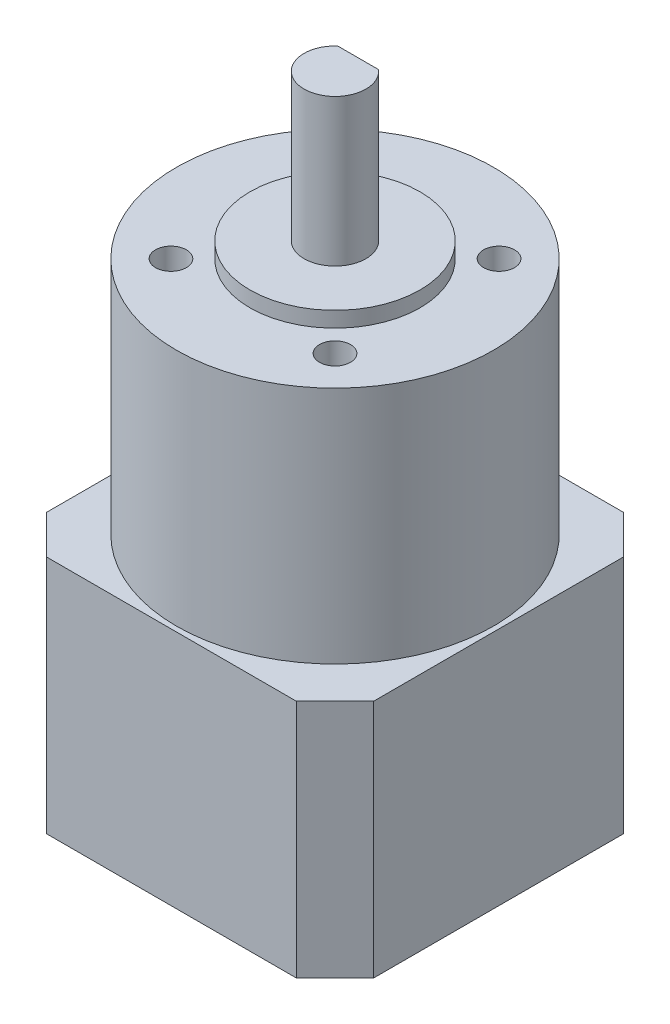
ISO-10303-21;
HEADER;
FILE_DESCRIPTION(('STEP AP214'),'2;1');
FILE_NAME('part.step','',(''),(''),'','','');
FILE_SCHEMA(('AUTOMOTIVE_DESIGN { 1 0 10303 214 1 1 1 1 }'));
ENDSEC;
DATA;
#1=APPLICATION_CONTEXT('core data for automotive mechanical design processes');
#2=APPLICATION_PROTOCOL_DEFINITION('international standard','automotive_design',2000,#1);
#3=PRODUCT_CONTEXT('',#1,'mechanical');
#4=PRODUCT('Part','Part','',(#3));
#5=PRODUCT_RELATED_PRODUCT_CATEGORY('part','',(#4));
#6=PRODUCT_DEFINITION_FORMATION('','',#4);
#7=PRODUCT_DEFINITION_CONTEXT('part definition',#1,'design');
#8=PRODUCT_DEFINITION('design','',#6,#7);
#9=PRODUCT_DEFINITION_SHAPE('','',#8);
#10=(LENGTH_UNIT() NAMED_UNIT(*) SI_UNIT(.MILLI.,.METRE.));
#11=(NAMED_UNIT(*) PLANE_ANGLE_UNIT() SI_UNIT($,.RADIAN.));
#12=(NAMED_UNIT(*) SI_UNIT($,.STERADIAN.) SOLID_ANGLE_UNIT());
#13=UNCERTAINTY_MEASURE_WITH_UNIT(LENGTH_MEASURE(1.E-05),#10,'distance_accuracy_value','');
#14=(GEOMETRIC_REPRESENTATION_CONTEXT(3) GLOBAL_UNCERTAINTY_ASSIGNED_CONTEXT((#13)) GLOBAL_UNIT_ASSIGNED_CONTEXT((#10,
#11,#12)) REPRESENTATION_CONTEXT('',''));
#15=CARTESIAN_POINT('',(0.,0.,0.));
#16=DIRECTION('',(0.,0.,1.));
#17=DIRECTION('',(1.,0.,0.));
#18=AXIS2_PLACEMENT_3D('',#15,#16,#17);
#19=CARTESIAN_POINT('',(0.,21.,0.));
#20=DIRECTION('',(0.,1.,0.));
#21=DIRECTION('',(0.,0.,1.));
#22=AXIS2_PLACEMENT_3D('',#19,#20,#21);
#23=PLANE('',#22);
#24=DIRECTION('',(1.,0.,0.));
#25=VECTOR('',#24,1.);
#26=CARTESIAN_POINT('',(-2.64575131106459,21.,-3.));
#27=LINE('',#26,#25);
#28=CARTESIAN_POINT('',(2.64575131106459,21.,-3.));
#29=VERTEX_POINT('',#28);
#30=CARTESIAN_POINT('',(-2.64575131106459,21.,-3.));
#31=VERTEX_POINT('',#30);
#32=EDGE_CURVE('E105',#29,#31,#27,.F.);
#33=ORIENTED_EDGE('',*,*,#32,.T.);
#34=CARTESIAN_POINT('',(0.,21.,0.));
#35=DIRECTION('',(0.,-1.,0.));
#36=DIRECTION('',(0.,0.,-1.));
#37=AXIS2_PLACEMENT_3D('',#34,#35,#36);
#38=CIRCLE('',#37,4.);
#39=EDGE_CURVE('E20',#29,#31,#38,.T.);
#40=ORIENTED_EDGE('',*,*,#39,.F.);
#41=EDGE_LOOP('',(#33,#40));
#42=FACE_BOUND('',#41,.T.);
#43=ADVANCED_FACE('F17',(#42),#23,.T.);
#44=CARTESIAN_POINT('',(0.,8.,0.));
#45=DIRECTION('',(0.,-1.,0.));
#46=DIRECTION('',(0.,0.,-1.));
#47=AXIS2_PLACEMENT_3D('',#44,#45,#46);
#48=PLANE('',#47);
#49=CARTESIAN_POINT('',(0.,8.,0.));
#50=DIRECTION('',(0.,-1.,0.));
#51=DIRECTION('',(0.,0.,-1.));
#52=AXIS2_PLACEMENT_3D('',#49,#50,#51);
#53=CIRCLE('',#52,4.);
#54=CARTESIAN_POINT('',(-2.64575131106459,8.,-3.));
#55=VERTEX_POINT('',#54);
#56=CARTESIAN_POINT('',(2.64575131106459,8.,-3.));
#57=VERTEX_POINT('',#56);
#58=EDGE_CURVE('E91',#55,#57,#53,.T.);
#59=ORIENTED_EDGE('',*,*,#58,.F.);
#60=DIRECTION('',(1.,0.,0.));
#61=VECTOR('',#60,1.);
#62=CARTESIAN_POINT('',(-2.64575131106459,8.,-3.));
#63=LINE('',#62,#61);
#64=EDGE_CURVE('E107',#55,#57,#63,.T.);
#65=ORIENTED_EDGE('',*,*,#64,.T.);
#66=EDGE_LOOP('',(#59,#65));
#67=FACE_BOUND('',#66,.T.);
#68=ADVANCED_FACE('F154',(#67),#48,.F.);
#69=CARTESIAN_POINT('',(-2.64575131106459,8.,-3.));
#70=DIRECTION('',(0.,0.,1.));
#71=DIRECTION('',(1.,0.,0.));
#72=AXIS2_PLACEMENT_3D('',#69,#70,#71);
#73=PLANE('',#72);
#74=DIRECTION('',(0.,-1.,0.));
#75=VECTOR('',#74,1.);
#76=CARTESIAN_POINT('',(2.64575131106459,21.,-3.));
#77=LINE('',#76,#75);
#78=EDGE_CURVE('E102',#57,#29,#77,.F.);
#79=ORIENTED_EDGE('',*,*,#78,.F.);
#80=ORIENTED_EDGE('',*,*,#64,.F.);
#81=DIRECTION('',(0.,-1.,0.));
#82=VECTOR('',#81,1.);
#83=CARTESIAN_POINT('',(-2.64575131106459,21.,-3.));
#84=LINE('',#83,#82);
#85=EDGE_CURVE('E100',#31,#55,#84,.T.);
#86=ORIENTED_EDGE('',*,*,#85,.F.);
#87=ORIENTED_EDGE('',*,*,#32,.F.);
#88=EDGE_LOOP('',(#79,#80,#86,#87));
#89=FACE_BOUND('',#88,.T.);
#90=ADVANCED_FACE('F109',(#89),#73,.F.);
#91=CARTESIAN_POINT('',(0.,21.,0.));
#92=DIRECTION('',(0.,-1.,0.));
#93=DIRECTION('',(0.,0.,-1.));
#94=AXIS2_PLACEMENT_3D('',#91,#92,#93);
#95=CYLINDRICAL_SURFACE('',#94,4.);
#96=CARTESIAN_POINT('',(0.,2.,0.));
#97=DIRECTION('',(0.,-1.,0.));
#98=DIRECTION('',(0.,0.,-1.));
#99=AXIS2_PLACEMENT_3D('',#96,#97,#98);
#100=CIRCLE('',#99,4.);
#101=CARTESIAN_POINT('',(0.,2.,-4.));
#102=VERTEX_POINT('',#101);
#103=EDGE_CURVE('E148',#102,#102,#100,.T.);
#104=ORIENTED_EDGE('',*,*,#103,.F.);
#105=EDGE_LOOP('',(#104));
#106=FACE_BOUND('',#105,.T.);
#107=ORIENTED_EDGE('',*,*,#58,.T.);
#108=ORIENTED_EDGE('',*,*,#78,.T.);
#109=ORIENTED_EDGE('',*,*,#39,.T.);
#110=ORIENTED_EDGE('',*,*,#85,.T.);
#111=EDGE_LOOP('',(#107,#108,#109,#110));
#112=FACE_BOUND('',#111,.T.);
#113=ADVANCED_FACE('F98',(#106,#112),#95,.T.);
#114=CARTESIAN_POINT('',(-16.15,-61.9,-16.15));
#115=DIRECTION('',(0.,-1.,0.));
#116=DIRECTION('',(0.,0.,-1.));
#117=AXIS2_PLACEMENT_3D('',#114,#115,#116);
#118=PLANE('',#117);
#119=DIRECTION('',(0.,0.,1.));
#120=VECTOR('',#119,1.);
#121=CARTESIAN_POINT('',(21.15,-61.9,16.15));
#122=LINE('',#121,#120);
#123=CARTESIAN_POINT('',(21.15,-61.9,-16.15));
#124=VERTEX_POINT('',#123);
#125=CARTESIAN_POINT('',(21.15,-61.9,16.1500000000001));
#126=VERTEX_POINT('',#125);
#127=EDGE_CURVE('E419',#124,#126,#122,.T.);
#128=ORIENTED_EDGE('',*,*,#127,.T.);
#129=DIRECTION('',(0.707106781186552,0.,-0.707106781186543));
#130=VECTOR('',#129,1.);
#131=CARTESIAN_POINT('',(21.1499999999999,-61.9,16.1500000000001));
#132=LINE('',#131,#130);
#133=CARTESIAN_POINT('',(16.1499999999999,-61.9,21.15));
#134=VERTEX_POINT('',#133);
#135=EDGE_CURVE('E422',#134,#126,#132,.T.);
#136=ORIENTED_EDGE('',*,*,#135,.F.);
#137=DIRECTION('',(-1.,0.,0.));
#138=VECTOR('',#137,1.);
#139=CARTESIAN_POINT('',(-16.15,-61.9,21.15));
#140=LINE('',#139,#138);
#141=CARTESIAN_POINT('',(-16.1500000000001,-61.9,21.15));
#142=VERTEX_POINT('',#141);
#143=EDGE_CURVE('E439',#134,#142,#140,.T.);
#144=ORIENTED_EDGE('',*,*,#143,.T.);
#145=DIRECTION('',(0.70710678118654,0.,0.707106781186555));
#146=VECTOR('',#145,1.);
#147=CARTESIAN_POINT('',(-16.1500000000002,-61.9,21.1499999999998));
#148=LINE('',#147,#146);
#149=CARTESIAN_POINT('',(-21.15,-61.9,16.1499999999999));
#150=VERTEX_POINT('',#149);
#151=EDGE_CURVE('E147',#150,#142,#148,.T.);
#152=ORIENTED_EDGE('',*,*,#151,.F.);
#153=DIRECTION('',(0.,0.,-1.));
#154=VECTOR('',#153,1.);
#155=CARTESIAN_POINT('',(-21.15,-61.9,16.15));
#156=LINE('',#155,#154);
#157=CARTESIAN_POINT('',(-21.15,-61.9,-16.1499999999999));
#158=VERTEX_POINT('',#157);
#159=EDGE_CURVE('E150',#150,#158,#156,.T.);
#160=ORIENTED_EDGE('',*,*,#159,.T.);
#161=DIRECTION('',(-0.707106781186548,0.,0.707106781186548));
#162=VECTOR('',#161,1.);
#163=CARTESIAN_POINT('',(-21.15,-61.9,-16.15));
#164=LINE('',#163,#162);
#165=CARTESIAN_POINT('',(-16.15,-61.9,-21.15));
#166=VERTEX_POINT('',#165);
#167=EDGE_CURVE('E453',#166,#158,#164,.T.);
#168=ORIENTED_EDGE('',*,*,#167,.F.);
#169=DIRECTION('',(1.,0.,0.));
#170=VECTOR('',#169,1.);
#171=CARTESIAN_POINT('',(-16.15,-61.9,-21.15));
#172=LINE('',#171,#170);
#173=CARTESIAN_POINT('',(16.15,-61.9,-21.15));
#174=VERTEX_POINT('',#173);
#175=EDGE_CURVE('E448',#166,#174,#172,.T.);
#176=ORIENTED_EDGE('',*,*,#175,.T.);
#177=DIRECTION('',(-0.707106781186545,0.,-0.70710678118655));
#178=VECTOR('',#177,1.);
#179=CARTESIAN_POINT('',(16.1500000000001,-61.9,-21.1499999999999));
#180=LINE('',#179,#178);
#181=EDGE_CURVE('E425',#124,#174,#180,.T.);
#182=ORIENTED_EDGE('',*,*,#181,.F.);
#183=EDGE_LOOP('',(#128,#136,#144,#152,#160,#168,#176,#182));
#184=FACE_BOUND('',#183,.T.);
#185=ADVANCED_FACE('F248',(#184),#118,.T.);
#186=CARTESIAN_POINT('',(-10.6066017177976,-5.,10.6066017177982));
#187=DIRECTION('',(0.,1.,0.));
#188=DIRECTION('',(0.,0.,1.));
#189=AXIS2_PLACEMENT_3D('',#186,#187,#188);
#190=PLANE('',#189);
#191=CARTESIAN_POINT('',(-10.6066017177976,-5.,10.6066017177982));
#192=DIRECTION('',(0.,1.,0.));
#193=DIRECTION('',(0.,0.,1.));
#194=AXIS2_PLACEMENT_3D('',#191,#192,#193);
#195=CIRCLE('',#194,2.);
#196=CARTESIAN_POINT('',(-10.6066017177976,-5.,12.6066017177982));
#197=VERTEX_POINT('',#196);
#198=EDGE_CURVE('E144',#197,#197,#195,.T.);
#199=ORIENTED_EDGE('',*,*,#198,.T.);
#200=EDGE_LOOP('',(#199));
#201=FACE_BOUND('',#200,.T.);
#202=ADVANCED_FACE('F244',(#201),#190,.T.);
#203=CARTESIAN_POINT('',(10.6066017177988,-5.,10.6066017177976));
#204=DIRECTION('',(0.,1.,0.));
#205=DIRECTION('',(0.,0.,1.));
#206=AXIS2_PLACEMENT_3D('',#203,#204,#205);
#207=PLANE('',#206);
#208=CARTESIAN_POINT('',(10.6066017177988,-5.,10.6066017177976));
#209=DIRECTION('',(0.,1.,0.));
#210=DIRECTION('',(0.,0.,1.));
#211=AXIS2_PLACEMENT_3D('',#208,#209,#210);
#212=CIRCLE('',#211,2.);
#213=CARTESIAN_POINT('',(10.6066017177988,-5.,12.6066017177976));
#214=VERTEX_POINT('',#213);
#215=EDGE_CURVE('E141',#214,#214,#212,.T.);
#216=ORIENTED_EDGE('',*,*,#215,.T.);
#217=EDGE_LOOP('',(#216));
#218=FACE_BOUND('',#217,.T.);
#219=ADVANCED_FACE('F240',(#218),#207,.T.);
#220=CARTESIAN_POINT('',(10.6066017177982,-5.,-10.6066017177988));
#221=DIRECTION('',(0.,1.,0.));
#222=DIRECTION('',(0.,0.,1.));
#223=AXIS2_PLACEMENT_3D('',#220,#221,#222);
#224=PLANE('',#223);
#225=CARTESIAN_POINT('',(10.6066017177982,-5.,-10.6066017177988));
#226=DIRECTION('',(0.,1.,0.));
#227=DIRECTION('',(0.,0.,1.));
#228=AXIS2_PLACEMENT_3D('',#225,#226,#227);
#229=CIRCLE('',#228,2.);
#230=CARTESIAN_POINT('',(10.6066017177982,-5.,-8.60660171779881));
#231=VERTEX_POINT('',#230);
#232=EDGE_CURVE('E138',#231,#231,#229,.T.);
#233=ORIENTED_EDGE('',*,*,#232,.T.);
#234=EDGE_LOOP('',(#233));
#235=FACE_BOUND('',#234,.T.);
#236=ADVANCED_FACE('F236',(#235),#224,.T.);
#237=CARTESIAN_POINT('',(-10.6066017177982,-5.,-10.6066017177982));
#238=DIRECTION('',(0.,1.,0.));
#239=DIRECTION('',(0.,0.,1.));
#240=AXIS2_PLACEMENT_3D('',#237,#238,#239);
#241=PLANE('',#240);
#242=CARTESIAN_POINT('',(-10.6066017177982,-5.,-10.6066017177982));
#243=DIRECTION('',(0.,1.,0.));
#244=DIRECTION('',(0.,0.,1.));
#245=AXIS2_PLACEMENT_3D('',#242,#243,#244);
#246=CIRCLE('',#245,2.);
#247=CARTESIAN_POINT('',(-10.6066017177982,-5.,-8.60660171779821));
#248=VERTEX_POINT('',#247);
#249=EDGE_CURVE('E135',#248,#248,#246,.T.);
#250=ORIENTED_EDGE('',*,*,#249,.T.);
#251=EDGE_LOOP('',(#250));
#252=FACE_BOUND('',#251,.T.);
#253=ADVANCED_FACE('F232',(#252),#241,.T.);
#254=CARTESIAN_POINT('',(0.,2.,0.));
#255=DIRECTION('',(0.,1.,0.));
#256=DIRECTION('',(0.,0.,1.));
#257=AXIS2_PLACEMENT_3D('',#254,#255,#256);
#258=PLANE('',#257);
#259=ORIENTED_EDGE('',*,*,#103,.T.);
#260=EDGE_LOOP('',(#259));
#261=FACE_BOUND('',#260,.T.);
#262=CARTESIAN_POINT('',(0.,2.,0.));
#263=DIRECTION('',(0.,-1.,0.));
#264=DIRECTION('',(0.,0.,-1.));
#265=AXIS2_PLACEMENT_3D('',#262,#263,#264);
#266=CIRCLE('',#265,11.);
#267=CARTESIAN_POINT('',(0.,2.,-11.));
#268=VERTEX_POINT('',#267);
#269=EDGE_CURVE('E131',#268,#268,#266,.T.);
#270=ORIENTED_EDGE('',*,*,#269,.F.);
#271=EDGE_LOOP('',(#270));
#272=FACE_BOUND('',#271,.T.);
#273=ADVANCED_FACE('F228',(#261,#272),#258,.T.);
#274=CARTESIAN_POINT('',(-21.15,-61.9,16.15));
#275=DIRECTION('',(1.,0.,0.));
#276=DIRECTION('',(0.,0.,-1.));
#277=AXIS2_PLACEMENT_3D('',#274,#275,#276);
#278=PLANE('',#277);
#279=DIRECTION('',(0.,1.,0.));
#280=VECTOR('',#279,1.);
#281=CARTESIAN_POINT('',(-21.15,-30.9,-16.15));
#282=LINE('',#281,#280);
#283=CARTESIAN_POINT('',(-21.15,-30.9,-16.15));
#284=VERTEX_POINT('',#283);
#285=EDGE_CURVE('E455',#158,#284,#282,.T.);
#286=ORIENTED_EDGE('',*,*,#285,.F.);
#287=ORIENTED_EDGE('',*,*,#159,.F.);
#288=DIRECTION('',(0.,1.,0.));
#289=VECTOR('',#288,1.);
#290=CARTESIAN_POINT('',(-21.15,-30.9,16.15));
#291=LINE('',#290,#289);
#292=CARTESIAN_POINT('',(-21.15,-30.9,16.15));
#293=VERTEX_POINT('',#292);
#294=EDGE_CURVE('E482',#293,#150,#291,.F.);
#295=ORIENTED_EDGE('',*,*,#294,.F.);
#296=DIRECTION('',(0.,0.,-1.));
#297=VECTOR('',#296,1.);
#298=CARTESIAN_POINT('',(-21.15,-30.9,-16.15));
#299=LINE('',#298,#297);
#300=EDGE_CURVE('E134',#293,#284,#299,.T.);
#301=ORIENTED_EDGE('',*,*,#300,.T.);
#302=EDGE_LOOP('',(#286,#287,#295,#301));
#303=FACE_BOUND('',#302,.T.);
#304=ADVANCED_FACE('F224',(#303),#278,.F.);
#305=CARTESIAN_POINT('',(-21.15,-30.9,-16.15));
#306=DIRECTION('',(-0.707106781186548,0.,-0.707106781186548));
#307=DIRECTION('',(-0.707106781186548,0.,0.707106781186548));
#308=AXIS2_PLACEMENT_3D('',#305,#306,#307);
#309=PLANE('',#308);
#310=DIRECTION('',(0.,1.,0.));
#311=VECTOR('',#310,1.);
#312=CARTESIAN_POINT('',(-16.15,-61.9,-21.15));
#313=LINE('',#312,#311);
#314=CARTESIAN_POINT('',(-16.15,-30.9,-21.15));
#315=VERTEX_POINT('',#314);
#316=EDGE_CURVE('E450',#315,#166,#313,.F.);
#317=ORIENTED_EDGE('',*,*,#316,.T.);
#318=ORIENTED_EDGE('',*,*,#167,.T.);
#319=ORIENTED_EDGE('',*,*,#285,.T.);
#320=DIRECTION('',(0.707106781186547,0.,-0.707106781186547));
#321=VECTOR('',#320,1.);
#322=CARTESIAN_POINT('',(-21.15,-30.9,-16.15));
#323=LINE('',#322,#321);
#324=EDGE_CURVE('E465',#284,#315,#323,.T.);
#325=ORIENTED_EDGE('',*,*,#324,.T.);
#326=EDGE_LOOP('',(#317,#318,#319,#325));
#327=FACE_BOUND('',#326,.T.);
#328=ADVANCED_FACE('F220',(#327),#309,.T.);
#329=CARTESIAN_POINT('',(-16.15,-61.9,-21.15));
#330=DIRECTION('',(0.,0.,1.));
#331=DIRECTION('',(1.,0.,0.));
#332=AXIS2_PLACEMENT_3D('',#329,#330,#331);
#333=PLANE('',#332);
#334=DIRECTION('',(0.,1.,0.));
#335=VECTOR('',#334,1.);
#336=CARTESIAN_POINT('',(16.1500000000001,-30.9,-21.1499999999999));
#337=LINE('',#336,#335);
#338=CARTESIAN_POINT('',(16.15,-30.9,-21.15));
#339=VERTEX_POINT('',#338);
#340=EDGE_CURVE('E445',#174,#339,#337,.T.);
#341=ORIENTED_EDGE('',*,*,#340,.F.);
#342=ORIENTED_EDGE('',*,*,#175,.F.);
#343=ORIENTED_EDGE('',*,*,#316,.F.);
#344=DIRECTION('',(1.,0.,0.));
#345=VECTOR('',#344,1.);
#346=CARTESIAN_POINT('',(-16.15,-30.9,-21.15));
#347=LINE('',#346,#345);
#348=EDGE_CURVE('E468',#315,#339,#347,.T.);
#349=ORIENTED_EDGE('',*,*,#348,.T.);
#350=EDGE_LOOP('',(#341,#342,#343,#349));
#351=FACE_BOUND('',#350,.T.);
#352=ADVANCED_FACE('F216',(#351),#333,.F.);
#353=CARTESIAN_POINT('',(16.1500000000001,-30.9,-21.1499999999999));
#354=DIRECTION('',(0.70710678118655,0.,-0.707106781186545));
#355=DIRECTION('',(-0.707106781186545,0.,-0.70710678118655));
#356=AXIS2_PLACEMENT_3D('',#353,#354,#355);
#357=PLANE('',#356);
#358=DIRECTION('',(0.,1.,0.));
#359=VECTOR('',#358,1.);
#360=CARTESIAN_POINT('',(21.15,-61.9,-16.15));
#361=LINE('',#360,#359);
#362=CARTESIAN_POINT('',(21.15,-30.9,-16.15));
#363=VERTEX_POINT('',#362);
#364=EDGE_CURVE('E429',#363,#124,#361,.F.);
#365=ORIENTED_EDGE('',*,*,#364,.T.);
#366=ORIENTED_EDGE('',*,*,#181,.T.);
#367=ORIENTED_EDGE('',*,*,#340,.T.);
#368=DIRECTION('',(0.707106781186548,0.,0.707106781186547));
#369=VECTOR('',#368,1.);
#370=CARTESIAN_POINT('',(16.1500000000001,-30.9,-21.1499999999999));
#371=LINE('',#370,#369);
#372=EDGE_CURVE('E470',#339,#363,#371,.T.);
#373=ORIENTED_EDGE('',*,*,#372,.T.);
#374=EDGE_LOOP('',(#365,#366,#367,#373));
#375=FACE_BOUND('',#374,.T.);
#376=ADVANCED_FACE('F212',(#375),#357,.T.);
#377=CARTESIAN_POINT('',(21.15,-61.9,16.15));
#378=DIRECTION('',(-1.,0.,0.));
#379=DIRECTION('',(0.,0.,1.));
#380=AXIS2_PLACEMENT_3D('',#377,#378,#379);
#381=PLANE('',#380);
#382=DIRECTION('',(0.,1.,0.));
#383=VECTOR('',#382,1.);
#384=CARTESIAN_POINT('',(21.1499999999999,-30.9,16.1500000000001));
#385=LINE('',#384,#383);
#386=CARTESIAN_POINT('',(21.15,-30.9,16.1500000000001));
#387=VERTEX_POINT('',#386);
#388=EDGE_CURVE('E428',#126,#387,#385,.T.);
#389=ORIENTED_EDGE('',*,*,#388,.F.);
#390=ORIENTED_EDGE('',*,*,#127,.F.);
#391=ORIENTED_EDGE('',*,*,#364,.F.);
#392=DIRECTION('',(0.,0.,-1.));
#393=VECTOR('',#392,1.);
#394=CARTESIAN_POINT('',(21.15,-30.9,-16.15));
#395=LINE('',#394,#393);
#396=EDGE_CURVE('E433',#363,#387,#395,.F.);
#397=ORIENTED_EDGE('',*,*,#396,.T.);
#398=EDGE_LOOP('',(#389,#390,#391,#397));
#399=FACE_BOUND('',#398,.T.);
#400=ADVANCED_FACE('F208',(#399),#381,.F.);
#401=CARTESIAN_POINT('',(21.1499999999999,-30.9,16.1500000000001));
#402=DIRECTION('',(0.707106781186543,0.,0.707106781186552));
#403=DIRECTION('',(0.707106781186552,0.,-0.707106781186543));
#404=AXIS2_PLACEMENT_3D('',#401,#402,#403);
#405=PLANE('',#404);
#406=DIRECTION('',(0.,1.,0.));
#407=VECTOR('',#406,1.);
#408=CARTESIAN_POINT('',(16.15,-61.9,21.15));
#409=LINE('',#408,#407);
#410=CARTESIAN_POINT('',(16.15,-30.9,21.15));
#411=VERTEX_POINT('',#410);
#412=EDGE_CURVE('E436',#411,#134,#409,.F.);
#413=ORIENTED_EDGE('',*,*,#412,.T.);
#414=ORIENTED_EDGE('',*,*,#135,.T.);
#415=ORIENTED_EDGE('',*,*,#388,.T.);
#416=DIRECTION('',(-0.707106781186548,0.,0.707106781186546));
#417=VECTOR('',#416,1.);
#418=CARTESIAN_POINT('',(21.1499999999999,-30.9,16.1500000000001));
#419=LINE('',#418,#417);
#420=EDGE_CURVE('E472',#387,#411,#419,.T.);
#421=ORIENTED_EDGE('',*,*,#420,.T.);
#422=EDGE_LOOP('',(#413,#414,#415,#421));
#423=FACE_BOUND('',#422,.T.);
#424=ADVANCED_FACE('F205',(#423),#405,.T.);
#425=CARTESIAN_POINT('',(-16.15,-61.9,21.15));
#426=DIRECTION('',(0.,0.,-1.));
#427=DIRECTION('',(-1.,0.,0.));
#428=AXIS2_PLACEMENT_3D('',#425,#426,#427);
#429=PLANE('',#428);
#430=DIRECTION('',(0.,1.,0.));
#431=VECTOR('',#430,1.);
#432=CARTESIAN_POINT('',(-16.1500000000002,-30.9,21.1499999999998));
#433=LINE('',#432,#431);
#434=CARTESIAN_POINT('',(-16.1500000000002,-30.9,21.15));
#435=VERTEX_POINT('',#434);
#436=EDGE_CURVE('E484',#142,#435,#433,.T.);
#437=ORIENTED_EDGE('',*,*,#436,.F.);
#438=ORIENTED_EDGE('',*,*,#143,.F.);
#439=ORIENTED_EDGE('',*,*,#412,.F.);
#440=DIRECTION('',(1.,0.,0.));
#441=VECTOR('',#440,1.);
#442=CARTESIAN_POINT('',(-16.15,-30.9,21.15));
#443=LINE('',#442,#441);
#444=EDGE_CURVE('E35',#411,#435,#443,.F.);
#445=ORIENTED_EDGE('',*,*,#444,.T.);
#446=EDGE_LOOP('',(#437,#438,#439,#445));
#447=FACE_BOUND('',#446,.T.);
#448=ADVANCED_FACE('F201',(#447),#429,.F.);
#449=CARTESIAN_POINT('',(-16.1500000000002,-30.9,21.1499999999998));
#450=DIRECTION('',(-0.707106781186555,0.,0.70710678118654));
#451=DIRECTION('',(0.70710678118654,0.,0.707106781186555));
#452=AXIS2_PLACEMENT_3D('',#449,#450,#451);
#453=PLANE('',#452);
#454=ORIENTED_EDGE('',*,*,#294,.T.);
#455=ORIENTED_EDGE('',*,*,#151,.T.);
#456=ORIENTED_EDGE('',*,*,#436,.T.);
#457=DIRECTION('',(-0.707106781186545,0.,-0.707106781186549));
#458=VECTOR('',#457,1.);
#459=CARTESIAN_POINT('',(-16.1500000000002,-30.9,21.1499999999998));
#460=LINE('',#459,#458);
#461=EDGE_CURVE('E130',#435,#293,#460,.T.);
#462=ORIENTED_EDGE('',*,*,#461,.T.);
#463=EDGE_LOOP('',(#454,#455,#456,#462));
#464=FACE_BOUND('',#463,.T.);
#465=ADVANCED_FACE('F197',(#464),#453,.T.);
#466=CARTESIAN_POINT('',(-10.6066017177976,-5.,10.6066017177982));
#467=DIRECTION('',(0.,1.,0.));
#468=DIRECTION('',(0.,0.,1.));
#469=AXIS2_PLACEMENT_3D('',#466,#467,#468);
#470=CYLINDRICAL_SURFACE('',#469,2.);
#471=ORIENTED_EDGE('',*,*,#198,.F.);
#472=EDGE_LOOP('',(#471));
#473=FACE_BOUND('',#472,.T.);
#474=CARTESIAN_POINT('',(-10.6066017177976,0.,10.6066017177982));
#475=DIRECTION('',(0.,1.,0.));
#476=DIRECTION('',(0.,0.,1.));
#477=AXIS2_PLACEMENT_3D('',#474,#475,#476);
#478=CIRCLE('',#477,2.);
#479=CARTESIAN_POINT('',(-10.6066017177976,0.,12.6066017177982));
#480=VERTEX_POINT('',#479);
#481=EDGE_CURVE('E127',#480,#480,#478,.T.);
#482=ORIENTED_EDGE('',*,*,#481,.T.);
#483=EDGE_LOOP('',(#482));
#484=FACE_BOUND('',#483,.T.);
#485=ADVANCED_FACE('F193',(#473,#484),#470,.F.);
#486=CARTESIAN_POINT('',(10.6066017177988,-5.,10.6066017177976));
#487=DIRECTION('',(0.,1.,0.));
#488=DIRECTION('',(0.,0.,1.));
#489=AXIS2_PLACEMENT_3D('',#486,#487,#488);
#490=CYLINDRICAL_SURFACE('',#489,2.);
#491=ORIENTED_EDGE('',*,*,#215,.F.);
#492=EDGE_LOOP('',(#491));
#493=FACE_BOUND('',#492,.T.);
#494=CARTESIAN_POINT('',(10.6066017177988,0.,10.6066017177976));
#495=DIRECTION('',(0.,1.,0.));
#496=DIRECTION('',(0.,0.,1.));
#497=AXIS2_PLACEMENT_3D('',#494,#495,#496);
#498=CIRCLE('',#497,2.);
#499=CARTESIAN_POINT('',(10.6066017177988,0.,12.6066017177976));
#500=VERTEX_POINT('',#499);
#501=EDGE_CURVE('E124',#500,#500,#498,.T.);
#502=ORIENTED_EDGE('',*,*,#501,.T.);
#503=EDGE_LOOP('',(#502));
#504=FACE_BOUND('',#503,.T.);
#505=ADVANCED_FACE('F189',(#493,#504),#490,.F.);
#506=CARTESIAN_POINT('',(10.6066017177982,-5.,-10.6066017177988));
#507=DIRECTION('',(0.,1.,0.));
#508=DIRECTION('',(0.,0.,1.));
#509=AXIS2_PLACEMENT_3D('',#506,#507,#508);
#510=CYLINDRICAL_SURFACE('',#509,2.);
#511=ORIENTED_EDGE('',*,*,#232,.F.);
#512=EDGE_LOOP('',(#511));
#513=FACE_BOUND('',#512,.T.);
#514=CARTESIAN_POINT('',(10.6066017177982,0.,-10.6066017177988));
#515=DIRECTION('',(0.,1.,0.));
#516=DIRECTION('',(0.,0.,1.));
#517=AXIS2_PLACEMENT_3D('',#514,#515,#516);
#518=CIRCLE('',#517,2.);
#519=CARTESIAN_POINT('',(10.6066017177982,0.,-8.60660171779881));
#520=VERTEX_POINT('',#519);
#521=EDGE_CURVE('E121',#520,#520,#518,.T.);
#522=ORIENTED_EDGE('',*,*,#521,.T.);
#523=EDGE_LOOP('',(#522));
#524=FACE_BOUND('',#523,.T.);
#525=ADVANCED_FACE('F185',(#513,#524),#510,.F.);
#526=CARTESIAN_POINT('',(-10.6066017177982,-5.,-10.6066017177982));
#527=DIRECTION('',(0.,1.,0.));
#528=DIRECTION('',(0.,0.,1.));
#529=AXIS2_PLACEMENT_3D('',#526,#527,#528);
#530=CYLINDRICAL_SURFACE('',#529,2.);
#531=ORIENTED_EDGE('',*,*,#249,.F.);
#532=EDGE_LOOP('',(#531));
#533=FACE_BOUND('',#532,.T.);
#534=CARTESIAN_POINT('',(-10.6066017177982,0.,-10.6066017177982));
#535=DIRECTION('',(0.,1.,0.));
#536=DIRECTION('',(0.,0.,1.));
#537=AXIS2_PLACEMENT_3D('',#534,#535,#536);
#538=CIRCLE('',#537,2.);
#539=CARTESIAN_POINT('',(-10.6066017177982,0.,-8.60660171779821));
#540=VERTEX_POINT('',#539);
#541=EDGE_CURVE('E118',#540,#540,#538,.T.);
#542=ORIENTED_EDGE('',*,*,#541,.T.);
#543=EDGE_LOOP('',(#542));
#544=FACE_BOUND('',#543,.T.);
#545=ADVANCED_FACE('F181',(#533,#544),#530,.F.);
#546=CARTESIAN_POINT('',(0.,2.,0.));
#547=DIRECTION('',(0.,-1.,0.));
#548=DIRECTION('',(0.,0.,-1.));
#549=AXIS2_PLACEMENT_3D('',#546,#547,#548);
#550=CYLINDRICAL_SURFACE('',#549,11.);
#551=CARTESIAN_POINT('',(0.,0.,0.));
#552=DIRECTION('',(0.,-1.,0.));
#553=DIRECTION('',(0.,0.,-1.));
#554=AXIS2_PLACEMENT_3D('',#551,#552,#553);
#555=CIRCLE('',#554,11.);
#556=CARTESIAN_POINT('',(0.,0.,-11.));
#557=VERTEX_POINT('',#556);
#558=EDGE_CURVE('E115',#557,#557,#555,.F.);
#559=ORIENTED_EDGE('',*,*,#558,.T.);
#560=EDGE_LOOP('',(#559));
#561=FACE_BOUND('',#560,.T.);
#562=ORIENTED_EDGE('',*,*,#269,.T.);
#563=EDGE_LOOP('',(#562));
#564=FACE_BOUND('',#563,.T.);
#565=ADVANCED_FACE('F177',(#561,#564),#550,.T.);
#566=CARTESIAN_POINT('',(-16.15,-30.9,-16.15));
#567=DIRECTION('',(0.,-1.,0.));
#568=DIRECTION('',(0.,0.,-1.));
#569=AXIS2_PLACEMENT_3D('',#566,#567,#568);
#570=PLANE('',#569);
#571=ORIENTED_EDGE('',*,*,#444,.F.);
#572=ORIENTED_EDGE('',*,*,#420,.F.);
#573=ORIENTED_EDGE('',*,*,#396,.F.);
#574=ORIENTED_EDGE('',*,*,#372,.F.);
#575=ORIENTED_EDGE('',*,*,#348,.F.);
#576=ORIENTED_EDGE('',*,*,#324,.F.);
#577=ORIENTED_EDGE('',*,*,#300,.F.);
#578=ORIENTED_EDGE('',*,*,#461,.F.);
#579=EDGE_LOOP('',(#571,#572,#573,#574,#575,#576,#577,#578));
#580=FACE_BOUND('',#579,.T.);
#581=CARTESIAN_POINT('',(0.,-30.9,0.));
#582=DIRECTION('',(0.,1.,0.));
#583=DIRECTION('',(0.,0.,1.));
#584=AXIS2_PLACEMENT_3D('',#581,#582,#583);
#585=CIRCLE('',#584,20.5);
#586=CARTESIAN_POINT('',(0.,-30.9,20.5));
#587=VERTEX_POINT('',#586);
#588=EDGE_CURVE('E26',#587,#587,#585,.T.);
#589=ORIENTED_EDGE('',*,*,#588,.F.);
#590=EDGE_LOOP('',(#589));
#591=FACE_BOUND('',#590,.T.);
#592=ADVANCED_FACE('F170',(#580,#591),#570,.F.);
#593=CARTESIAN_POINT('',(0.,0.,0.));
#594=DIRECTION('',(0.,-1.,0.));
#595=DIRECTION('',(0.,0.,-1.));
#596=AXIS2_PLACEMENT_3D('',#593,#594,#595);
#597=PLANE('',#596);
#598=ORIENTED_EDGE('',*,*,#558,.F.);
#599=EDGE_LOOP('',(#598));
#600=FACE_BOUND('',#599,.T.);
#601=CARTESIAN_POINT('',(0.,0.,0.));
#602=DIRECTION('',(0.,1.,0.));
#603=DIRECTION('',(0.,0.,1.));
#604=AXIS2_PLACEMENT_3D('',#601,#602,#603);
#605=CIRCLE('',#604,20.5);
#606=CARTESIAN_POINT('',(0.,0.,20.5));
#607=VERTEX_POINT('',#606);
#608=EDGE_CURVE('E11',#607,#607,#605,.F.);
#609=ORIENTED_EDGE('',*,*,#608,.F.);
#610=EDGE_LOOP('',(#609));
#611=FACE_BOUND('',#610,.T.);
#612=ORIENTED_EDGE('',*,*,#541,.F.);
#613=EDGE_LOOP('',(#612));
#614=FACE_BOUND('',#613,.T.);
#615=ORIENTED_EDGE('',*,*,#521,.F.);
#616=EDGE_LOOP('',(#615));
#617=FACE_BOUND('',#616,.T.);
#618=ORIENTED_EDGE('',*,*,#501,.F.);
#619=EDGE_LOOP('',(#618));
#620=FACE_BOUND('',#619,.T.);
#621=ORIENTED_EDGE('',*,*,#481,.F.);
#622=EDGE_LOOP('',(#621));
#623=FACE_BOUND('',#622,.T.);
#624=ADVANCED_FACE('F164',(#600,#611,#614,#617,#620,#623),#597,.F.);
#625=CARTESIAN_POINT('',(0.,-30.9,0.));
#626=DIRECTION('',(0.,1.,0.));
#627=DIRECTION('',(0.,0.,1.));
#628=AXIS2_PLACEMENT_3D('',#625,#626,#627);
#629=CYLINDRICAL_SURFACE('',#628,20.5);
#630=ORIENTED_EDGE('',*,*,#588,.T.);
#631=EDGE_LOOP('',(#630));
#632=FACE_BOUND('',#631,.T.);
#633=ORIENTED_EDGE('',*,*,#608,.T.);
#634=EDGE_LOOP('',(#633));
#635=FACE_BOUND('',#634,.T.);
#636=ADVANCED_FACE('F162',(#632,#635),#629,.T.);
#637=CLOSED_SHELL('',(#43,#68,#90,#113,#185,#202,#219,#236,#253,#273,#304,#328,#352,#376,#400,
#424,#448,#465,#485,#505,#525,#545,#565,#592,#624,#636));
#638=MANIFOLD_SOLID_BREP('B1',#637);
#639=ADVANCED_BREP_SHAPE_REPRESENTATION('',(#18,#638),#14);
#640=SHAPE_DEFINITION_REPRESENTATION(#9,#639);
ENDSEC;
END-ISO-10303-21;
